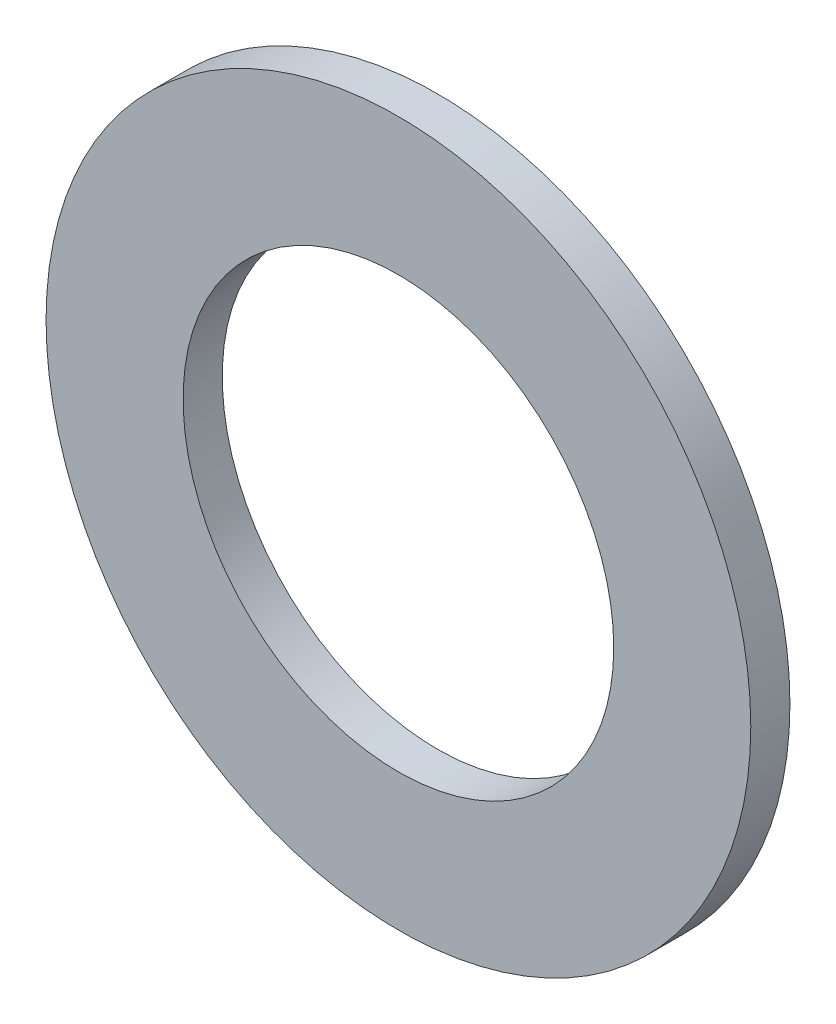
ISO-10303-21;
HEADER;
FILE_DESCRIPTION(('STEP AP214'),'2;1');
FILE_NAME('part.step','',(''),(''),'','','');
FILE_SCHEMA(('AUTOMOTIVE_DESIGN { 1 0 10303 214 1 1 1 1 }'));
ENDSEC;
DATA;
#1=APPLICATION_CONTEXT('core data for automotive mechanical design processes');
#2=APPLICATION_PROTOCOL_DEFINITION('international standard','automotive_design',2000,#1);
#3=PRODUCT_CONTEXT('',#1,'mechanical');
#4=PRODUCT('Part','Part','',(#3));
#5=PRODUCT_RELATED_PRODUCT_CATEGORY('part','',(#4));
#6=PRODUCT_DEFINITION_FORMATION('','',#4);
#7=PRODUCT_DEFINITION_CONTEXT('part definition',#1,'design');
#8=PRODUCT_DEFINITION('design','',#6,#7);
#9=PRODUCT_DEFINITION_SHAPE('','',#8);
#10=(LENGTH_UNIT() NAMED_UNIT(*) SI_UNIT(.MILLI.,.METRE.));
#11=(NAMED_UNIT(*) PLANE_ANGLE_UNIT() SI_UNIT($,.RADIAN.));
#12=(NAMED_UNIT(*) SI_UNIT($,.STERADIAN.) SOLID_ANGLE_UNIT());
#13=UNCERTAINTY_MEASURE_WITH_UNIT(LENGTH_MEASURE(1.E-05),#10,'distance_accuracy_value','');
#14=(GEOMETRIC_REPRESENTATION_CONTEXT(3) GLOBAL_UNCERTAINTY_ASSIGNED_CONTEXT((#13)) GLOBAL_UNIT_ASSIGNED_CONTEXT((#10,
#11,#12)) REPRESENTATION_CONTEXT('',''));
#15=CARTESIAN_POINT('',(0.,0.,0.));
#16=DIRECTION('',(0.,0.,1.));
#17=DIRECTION('',(1.,0.,0.));
#18=AXIS2_PLACEMENT_3D('',#15,#16,#17);
#19=CARTESIAN_POINT('',(0.,0.,4.));
#20=DIRECTION('',(0.,0.,1.));
#21=DIRECTION('',(1.,0.,0.));
#22=AXIS2_PLACEMENT_3D('',#19,#20,#21);
#23=PLANE('',#22);
#24=CARTESIAN_POINT('',(0.,0.,4.));
#25=DIRECTION('',(0.,0.,1.));
#26=DIRECTION('',(1.,0.,0.));
#27=AXIS2_PLACEMENT_3D('',#24,#25,#26);
#28=CIRCLE('',#27,36.);
#29=CARTESIAN_POINT('',(36.0000000000002,0.,4.00000000000005));
#30=VERTEX_POINT('',#29);
#31=EDGE_CURVE('E10',#30,#30,#28,.T.);
#32=ORIENTED_EDGE('',*,*,#31,.T.);
#33=EDGE_LOOP('',(#32));
#34=FACE_BOUND('',#33,.T.);
#35=CARTESIAN_POINT('',(0.,0.,4.));
#36=DIRECTION('',(0.,0.,1.));
#37=DIRECTION('',(1.,0.,0.));
#38=AXIS2_PLACEMENT_3D('',#35,#36,#37);
#39=CIRCLE('',#38,22.);
#40=CARTESIAN_POINT('',(22.0000000000001,0.,4.00000000000003));
#41=VERTEX_POINT('',#40);
#42=EDGE_CURVE('E39',#41,#41,#39,.T.);
#43=ORIENTED_EDGE('',*,*,#42,.F.);
#44=EDGE_LOOP('',(#43));
#45=FACE_BOUND('',#44,.T.);
#46=ADVANCED_FACE('F28',(#34,#45),#23,.T.);
#47=CARTESIAN_POINT('',(0.,0.,0.));
#48=DIRECTION('',(0.,0.,1.));
#49=DIRECTION('',(1.,0.,0.));
#50=AXIS2_PLACEMENT_3D('',#47,#48,#49);
#51=PLANE('',#50);
#52=CARTESIAN_POINT('',(0.,0.,0.));
#53=DIRECTION('',(0.,0.,1.));
#54=DIRECTION('',(1.,0.,0.));
#55=AXIS2_PLACEMENT_3D('',#52,#53,#54);
#56=CIRCLE('',#55,36.);
#57=CARTESIAN_POINT('',(36.0000000000002,0.,0.));
#58=VERTEX_POINT('',#57);
#59=EDGE_CURVE('E32',#58,#58,#56,.T.);
#60=ORIENTED_EDGE('',*,*,#59,.F.);
#61=EDGE_LOOP('',(#60));
#62=FACE_BOUND('',#61,.T.);
#63=CARTESIAN_POINT('',(0.,0.,0.));
#64=DIRECTION('',(0.,0.,1.));
#65=DIRECTION('',(1.,0.,0.));
#66=AXIS2_PLACEMENT_3D('',#63,#64,#65);
#67=CIRCLE('',#66,22.);
#68=CARTESIAN_POINT('',(22.0000000000001,0.,0.));
#69=VERTEX_POINT('',#68);
#70=EDGE_CURVE('E41',#69,#69,#67,.T.);
#71=ORIENTED_EDGE('',*,*,#70,.T.);
#72=EDGE_LOOP('',(#71));
#73=FACE_BOUND('',#72,.T.);
#74=ADVANCED_FACE('F51',(#62,#73),#51,.F.);
#75=CARTESIAN_POINT('',(0.,0.,4.));
#76=DIRECTION('',(0.,0.,-1.));
#77=DIRECTION('',(-1.,0.,0.));
#78=AXIS2_PLACEMENT_3D('',#75,#76,#77);
#79=CYLINDRICAL_SURFACE('',#78,36.);
#80=ORIENTED_EDGE('',*,*,#31,.F.);
#81=EDGE_LOOP('',(#80));
#82=FACE_BOUND('',#81,.T.);
#83=ORIENTED_EDGE('',*,*,#59,.T.);
#84=EDGE_LOOP('',(#83));
#85=FACE_BOUND('',#84,.T.);
#86=ADVANCED_FACE('F30',(#82,#85),#79,.T.);
#87=CARTESIAN_POINT('',(0.,0.,4.));
#88=DIRECTION('',(0.,0.,-1.));
#89=DIRECTION('',(-1.,0.,0.));
#90=AXIS2_PLACEMENT_3D('',#87,#88,#89);
#91=CYLINDRICAL_SURFACE('',#90,22.);
#92=ORIENTED_EDGE('',*,*,#42,.T.);
#93=EDGE_LOOP('',(#92));
#94=FACE_BOUND('',#93,.T.);
#95=ORIENTED_EDGE('',*,*,#70,.F.);
#96=EDGE_LOOP('',(#95));
#97=FACE_BOUND('',#96,.T.);
#98=ADVANCED_FACE('F47',(#94,#97),#91,.F.);
#99=CLOSED_SHELL('',(#46,#74,#86,#98));
#100=MANIFOLD_SOLID_BREP('B2',#99);
#101=ADVANCED_BREP_SHAPE_REPRESENTATION('',(#18,#100),#14);
#102=SHAPE_DEFINITION_REPRESENTATION(#9,#101);
ENDSEC;
END-ISO-10303-21;
